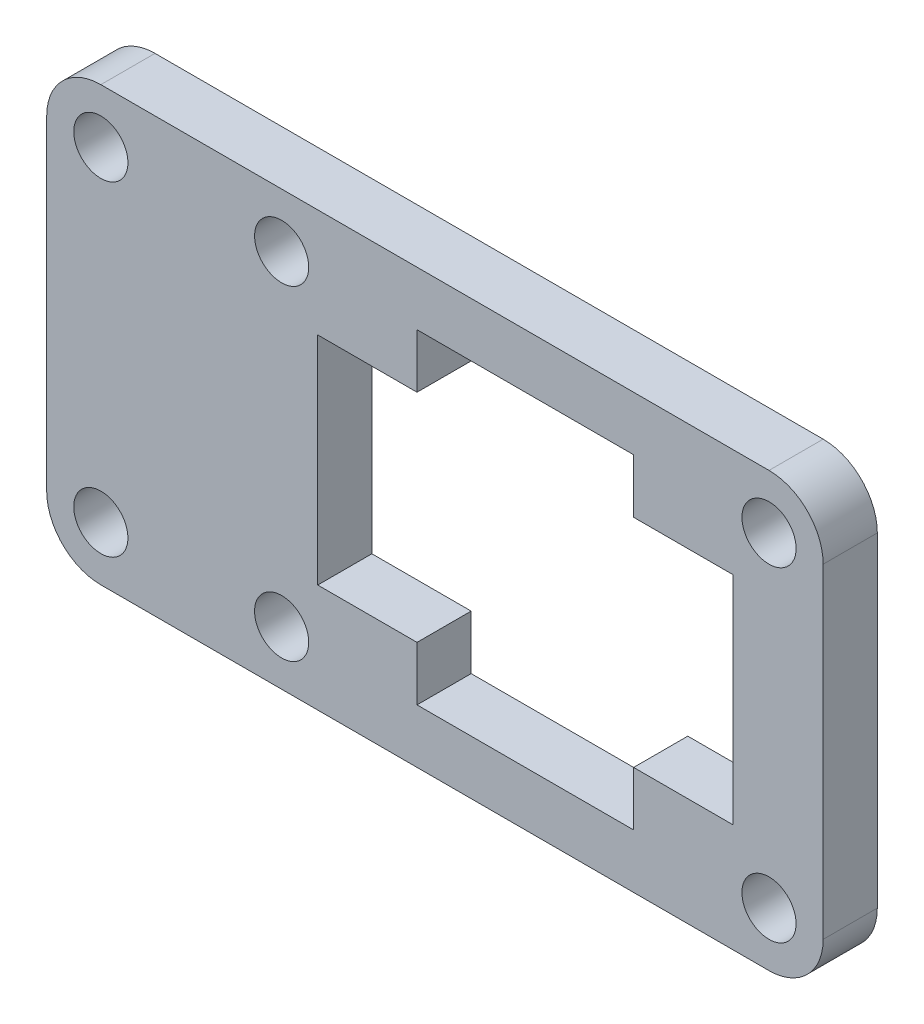
ISO-10303-21;
HEADER;
FILE_DESCRIPTION(('STEP AP214'),'2;1');
FILE_NAME('part.step','',(''),(''),'','','');
FILE_SCHEMA(('AUTOMOTIVE_DESIGN { 1 0 10303 214 1 1 1 1 }'));
ENDSEC;
DATA;
#1=APPLICATION_CONTEXT('core data for automotive mechanical design processes');
#2=APPLICATION_PROTOCOL_DEFINITION('international standard','automotive_design',2000,#1);
#3=PRODUCT_CONTEXT('',#1,'mechanical');
#4=PRODUCT('Part','Part','',(#3));
#5=PRODUCT_RELATED_PRODUCT_CATEGORY('part','',(#4));
#6=PRODUCT_DEFINITION_FORMATION('','',#4);
#7=PRODUCT_DEFINITION_CONTEXT('part definition',#1,'design');
#8=PRODUCT_DEFINITION('design','',#6,#7);
#9=PRODUCT_DEFINITION_SHAPE('','',#8);
#10=(LENGTH_UNIT() NAMED_UNIT(*) SI_UNIT(.MILLI.,.METRE.));
#11=(NAMED_UNIT(*) PLANE_ANGLE_UNIT() SI_UNIT($,.RADIAN.));
#12=(NAMED_UNIT(*) SI_UNIT($,.STERADIAN.) SOLID_ANGLE_UNIT());
#13=UNCERTAINTY_MEASURE_WITH_UNIT(LENGTH_MEASURE(1.E-05),#10,'distance_accuracy_value','');
#14=(GEOMETRIC_REPRESENTATION_CONTEXT(3) GLOBAL_UNCERTAINTY_ASSIGNED_CONTEXT((#13)) GLOBAL_UNIT_ASSIGNED_CONTEXT((#10,
#11,#12)) REPRESENTATION_CONTEXT('',''));
#15=CARTESIAN_POINT('',(0.,0.,0.));
#16=DIRECTION('',(0.,0.,1.));
#17=DIRECTION('',(1.,0.,0.));
#18=AXIS2_PLACEMENT_3D('',#15,#16,#17);
#19=CARTESIAN_POINT('',(63.748376395524,-38.3124718985925,3.));
#20=DIRECTION('',(0.,0.,-1.));
#21=DIRECTION('',(-1.,0.,0.));
#22=AXIS2_PLACEMENT_3D('',#19,#20,#21);
#23=PLANE('',#22);
#24=CARTESIAN_POINT('',(36.748376395524,-38.3124718985925,3.));
#25=DIRECTION('',(0.,0.,1.));
#26=DIRECTION('',(1.,0.,0.));
#27=AXIS2_PLACEMENT_3D('',#24,#25,#26);
#28=CIRCLE('',#27,1.5);
#29=CARTESIAN_POINT('',(38.248376395524,-38.3124718985925,3.));
#30=VERTEX_POINT('',#29);
#31=EDGE_CURVE('E471',#30,#30,#28,.T.);
#32=ORIENTED_EDGE('',*,*,#31,.F.);
#33=EDGE_LOOP('',(#32));
#34=FACE_BOUND('',#33,.T.);
#35=CARTESIAN_POINT('',(63.748376395524,-56.3124718985925,3.));
#36=DIRECTION('',(0.,0.,1.));
#37=DIRECTION('',(1.,0.,0.));
#38=AXIS2_PLACEMENT_3D('',#35,#36,#37);
#39=CIRCLE('',#38,1.5);
#40=CARTESIAN_POINT('',(65.248376395524,-56.3124718985925,3.));
#41=VERTEX_POINT('',#40);
#42=EDGE_CURVE('E483',#41,#41,#39,.T.);
#43=ORIENTED_EDGE('',*,*,#42,.F.);
#44=EDGE_LOOP('',(#43));
#45=FACE_BOUND('',#44,.T.);
#46=CARTESIAN_POINT('',(26.7321907696324,-38.3124718985925,3.));
#47=DIRECTION('',(0.,0.,1.));
#48=DIRECTION('',(1.,0.,0.));
#49=AXIS2_PLACEMENT_3D('',#46,#47,#48);
#50=CIRCLE('',#49,1.5);
#51=CARTESIAN_POINT('',(28.2321907696324,-38.3124718985925,3.));
#52=VERTEX_POINT('',#51);
#53=EDGE_CURVE('E222',#52,#52,#50,.T.);
#54=ORIENTED_EDGE('',*,*,#53,.F.);
#55=EDGE_LOOP('',(#54));
#56=FACE_BOUND('',#55,.T.);
#57=CARTESIAN_POINT('',(63.748376395524,-38.3124718985925,3.));
#58=DIRECTION('',(0.,0.,1.));
#59=DIRECTION('',(-1.,0.,0.));
#60=AXIS2_PLACEMENT_3D('',#57,#58,#59);
#61=CIRCLE('',#60,3.);
#62=CARTESIAN_POINT('',(66.748376395524,-38.3124718985925,3.));
#63=VERTEX_POINT('',#62);
#64=CARTESIAN_POINT('',(63.748376395524,-35.3124718985925,3.));
#65=VERTEX_POINT('',#64);
#66=EDGE_CURVE('E272',#63,#65,#61,.T.);
#67=ORIENTED_EDGE('',*,*,#66,.T.);
#68=DIRECTION('',(-1.,0.,0.));
#69=VECTOR('',#68,1.);
#70=CARTESIAN_POINT('',(26.7321907696324,-35.3124718985925,3.));
#71=LINE('',#70,#69);
#72=CARTESIAN_POINT('',(26.7321907696324,-35.3124718985925,3.));
#73=VERTEX_POINT('',#72);
#74=EDGE_CURVE('E275',#65,#73,#71,.T.);
#75=ORIENTED_EDGE('',*,*,#74,.T.);
#76=CARTESIAN_POINT('',(26.7321907696324,-38.3124718985925,3.));
#77=DIRECTION('',(0.,0.,1.));
#78=DIRECTION('',(1.,0.,0.));
#79=AXIS2_PLACEMENT_3D('',#76,#77,#78);
#80=CIRCLE('',#79,3.);
#81=CARTESIAN_POINT('',(23.7321907696324,-38.3124718985925,3.));
#82=VERTEX_POINT('',#81);
#83=EDGE_CURVE('E278',#73,#82,#80,.T.);
#84=ORIENTED_EDGE('',*,*,#83,.T.);
#85=DIRECTION('',(0.,-1.,0.));
#86=VECTOR('',#85,1.);
#87=CARTESIAN_POINT('',(23.7321907696324,-38.3124718985925,3.));
#88=LINE('',#87,#86);
#89=CARTESIAN_POINT('',(23.7321907696324,-56.3124718985925,3.));
#90=VERTEX_POINT('',#89);
#91=EDGE_CURVE('E280',#82,#90,#88,.T.);
#92=ORIENTED_EDGE('',*,*,#91,.T.);
#93=CARTESIAN_POINT('',(26.7321907696324,-56.3124718985925,3.));
#94=DIRECTION('',(0.,0.,1.));
#95=DIRECTION('',(1.,0.,0.));
#96=AXIS2_PLACEMENT_3D('',#93,#94,#95);
#97=CIRCLE('',#96,3.);
#98=CARTESIAN_POINT('',(26.7321907696324,-59.3124718985925,3.));
#99=VERTEX_POINT('',#98);
#100=EDGE_CURVE('E282',#90,#99,#97,.T.);
#101=ORIENTED_EDGE('',*,*,#100,.T.);
#102=DIRECTION('',(1.,0.,0.));
#103=VECTOR('',#102,1.);
#104=CARTESIAN_POINT('',(26.7321907696324,-59.3124718985925,3.));
#105=LINE('',#104,#103);
#106=CARTESIAN_POINT('',(63.748376395524,-59.3124718985925,3.));
#107=VERTEX_POINT('',#106);
#108=EDGE_CURVE('E284',#99,#107,#105,.T.);
#109=ORIENTED_EDGE('',*,*,#108,.T.);
#110=CARTESIAN_POINT('',(63.748376395524,-56.3124718985925,3.));
#111=DIRECTION('',(0.,0.,1.));
#112=DIRECTION('',(1.,0.,0.));
#113=AXIS2_PLACEMENT_3D('',#110,#111,#112);
#114=CIRCLE('',#113,3.);
#115=CARTESIAN_POINT('',(66.748376395524,-56.3124718985925,3.));
#116=VERTEX_POINT('',#115);
#117=EDGE_CURVE('E286',#107,#116,#114,.T.);
#118=ORIENTED_EDGE('',*,*,#117,.T.);
#119=DIRECTION('',(0.,1.,0.));
#120=VECTOR('',#119,1.);
#121=CARTESIAN_POINT('',(66.748376395524,-38.3124718985925,3.));
#122=LINE('',#121,#120);
#123=EDGE_CURVE('E288',#116,#63,#122,.T.);
#124=ORIENTED_EDGE('',*,*,#123,.T.);
#125=EDGE_LOOP('',(#67,#75,#84,#92,#101,#109,#118,#124));
#126=FACE_BOUND('',#125,.T.);
#127=DIRECTION('',(0.,-1.,0.));
#128=VECTOR('',#127,1.);
#129=CARTESIAN_POINT('',(38.748376395524,-53.3124718985925,3.));
#130=LINE('',#129,#128);
#131=CARTESIAN_POINT('',(38.748376395524,-41.3124718985925,3.));
#132=VERTEX_POINT('',#131);
#133=CARTESIAN_POINT('',(38.748376395524,-53.3124718985925,3.));
#134=VERTEX_POINT('',#133);
#135=EDGE_CURVE('E176',#132,#134,#130,.T.);
#136=ORIENTED_EDGE('',*,*,#135,.F.);
#137=DIRECTION('',(-1.,0.,0.));
#138=VECTOR('',#137,1.);
#139=CARTESIAN_POINT('',(38.748376395524,-41.3124718985925,3.));
#140=LINE('',#139,#138);
#141=CARTESIAN_POINT('',(44.248376395524,-41.3124718985925,3.));
#142=VERTEX_POINT('',#141);
#143=EDGE_CURVE('E219',#142,#132,#140,.T.);
#144=ORIENTED_EDGE('',*,*,#143,.F.);
#145=DIRECTION('',(0.,-1.,0.));
#146=VECTOR('',#145,1.);
#147=CARTESIAN_POINT('',(44.248376395524,-41.3124718985925,3.));
#148=LINE('',#147,#146);
#149=CARTESIAN_POINT('',(44.248376395524,-38.3124718985925,3.));
#150=VERTEX_POINT('',#149);
#151=EDGE_CURVE('E217',#150,#142,#148,.T.);
#152=ORIENTED_EDGE('',*,*,#151,.F.);
#153=DIRECTION('',(-1.,0.,0.));
#154=VECTOR('',#153,1.);
#155=CARTESIAN_POINT('',(56.248376395524,-38.3124718985925,3.));
#156=LINE('',#155,#154);
#157=CARTESIAN_POINT('',(56.248376395524,-38.3124718985925,3.));
#158=VERTEX_POINT('',#157);
#159=EDGE_CURVE('E215',#158,#150,#156,.T.);
#160=ORIENTED_EDGE('',*,*,#159,.F.);
#161=DIRECTION('',(0.,1.,0.));
#162=VECTOR('',#161,1.);
#163=CARTESIAN_POINT('',(56.248376395524,-41.3124718985925,3.));
#164=LINE('',#163,#162);
#165=CARTESIAN_POINT('',(56.248376395524,-41.3124718985925,3.));
#166=VERTEX_POINT('',#165);
#167=EDGE_CURVE('E213',#166,#158,#164,.T.);
#168=ORIENTED_EDGE('',*,*,#167,.F.);
#169=DIRECTION('',(-1.,0.,0.));
#170=VECTOR('',#169,1.);
#171=CARTESIAN_POINT('',(56.248376395524,-41.3124718985925,3.));
#172=LINE('',#171,#170);
#173=CARTESIAN_POINT('',(61.748376395524,-41.3124718985925,3.));
#174=VERTEX_POINT('',#173);
#175=EDGE_CURVE('E211',#174,#166,#172,.T.);
#176=ORIENTED_EDGE('',*,*,#175,.F.);
#177=DIRECTION('',(0.,1.,0.));
#178=VECTOR('',#177,1.);
#179=CARTESIAN_POINT('',(61.748376395524,-53.3124718985925,3.));
#180=LINE('',#179,#178);
#181=CARTESIAN_POINT('',(61.748376395524,-53.3124718985925,3.));
#182=VERTEX_POINT('',#181);
#183=EDGE_CURVE('E209',#182,#174,#180,.T.);
#184=ORIENTED_EDGE('',*,*,#183,.F.);
#185=DIRECTION('',(1.,0.,0.));
#186=VECTOR('',#185,1.);
#187=CARTESIAN_POINT('',(56.248376395524,-53.3124718985925,3.));
#188=LINE('',#187,#186);
#189=CARTESIAN_POINT('',(56.248376395524,-53.3124718985925,3.));
#190=VERTEX_POINT('',#189);
#191=EDGE_CURVE('E207',#190,#182,#188,.T.);
#192=ORIENTED_EDGE('',*,*,#191,.F.);
#193=DIRECTION('',(0.,1.,0.));
#194=VECTOR('',#193,1.);
#195=CARTESIAN_POINT('',(56.248376395524,-56.3124718985925,3.));
#196=LINE('',#195,#194);
#197=CARTESIAN_POINT('',(56.248376395524,-56.3124718985925,3.));
#198=VERTEX_POINT('',#197);
#199=EDGE_CURVE('E205',#198,#190,#196,.T.);
#200=ORIENTED_EDGE('',*,*,#199,.F.);
#201=DIRECTION('',(1.,0.,0.));
#202=VECTOR('',#201,1.);
#203=CARTESIAN_POINT('',(56.248376395524,-56.3124718985925,3.));
#204=LINE('',#203,#202);
#205=CARTESIAN_POINT('',(44.248376395524,-56.3124718985925,3.));
#206=VERTEX_POINT('',#205);
#207=EDGE_CURVE('E200',#206,#198,#204,.T.);
#208=ORIENTED_EDGE('',*,*,#207,.F.);
#209=DIRECTION('',(0.,-1.,0.));
#210=VECTOR('',#209,1.);
#211=CARTESIAN_POINT('',(44.248376395524,-56.3124718985925,3.));
#212=LINE('',#211,#210);
#213=CARTESIAN_POINT('',(44.248376395524,-53.3124718985925,3.));
#214=VERTEX_POINT('',#213);
#215=EDGE_CURVE('E198',#214,#206,#212,.T.);
#216=ORIENTED_EDGE('',*,*,#215,.F.);
#217=DIRECTION('',(1.,0.,0.));
#218=VECTOR('',#217,1.);
#219=CARTESIAN_POINT('',(38.748376395524,-53.3124718985925,3.));
#220=LINE('',#219,#218);
#221=EDGE_CURVE('E184',#134,#214,#220,.T.);
#222=ORIENTED_EDGE('',*,*,#221,.F.);
#223=EDGE_LOOP('',(#136,#144,#152,#160,#168,#176,#184,#192,#200,#208,#216,#222));
#224=FACE_BOUND('',#223,.T.);
#225=CARTESIAN_POINT('',(63.748376395524,-38.3124718985925,3.));
#226=DIRECTION('',(0.,0.,1.));
#227=DIRECTION('',(1.,0.,0.));
#228=AXIS2_PLACEMENT_3D('',#225,#226,#227);
#229=CIRCLE('',#228,1.5);
#230=CARTESIAN_POINT('',(65.248376395524,-38.3124718985925,3.));
#231=VERTEX_POINT('',#230);
#232=EDGE_CURVE('E489',#231,#231,#229,.T.);
#233=ORIENTED_EDGE('',*,*,#232,.F.);
#234=EDGE_LOOP('',(#233));
#235=FACE_BOUND('',#234,.T.);
#236=CARTESIAN_POINT('',(26.7321907696324,-56.3124718985925,3.));
#237=DIRECTION('',(0.,0.,1.));
#238=DIRECTION('',(1.,0.,0.));
#239=AXIS2_PLACEMENT_3D('',#236,#237,#238);
#240=CIRCLE('',#239,1.5);
#241=CARTESIAN_POINT('',(28.2321907696324,-56.3124718985925,3.));
#242=VERTEX_POINT('',#241);
#243=EDGE_CURVE('E477',#242,#242,#240,.T.);
#244=ORIENTED_EDGE('',*,*,#243,.F.);
#245=EDGE_LOOP('',(#244));
#246=FACE_BOUND('',#245,.T.);
#247=CARTESIAN_POINT('',(36.748376395524,-56.3124718985925,3.));
#248=DIRECTION('',(0.,0.,1.));
#249=DIRECTION('',(1.,0.,0.));
#250=AXIS2_PLACEMENT_3D('',#247,#248,#249);
#251=CIRCLE('',#250,1.5);
#252=CARTESIAN_POINT('',(38.248376395524,-56.3124718985925,3.));
#253=VERTEX_POINT('',#252);
#254=EDGE_CURVE('E462',#253,#253,#251,.T.);
#255=ORIENTED_EDGE('',*,*,#254,.F.);
#256=EDGE_LOOP('',(#255));
#257=FACE_BOUND('',#256,.T.);
#258=ADVANCED_FACE('F39',(#34,#45,#56,#126,#224,#235,#246,#257),#23,.F.);
#259=CARTESIAN_POINT('',(63.748376395524,-38.3124718985925,0.));
#260=DIRECTION('',(0.,0.,-1.));
#261=DIRECTION('',(-1.,0.,0.));
#262=AXIS2_PLACEMENT_3D('',#259,#260,#261);
#263=PLANE('',#262);
#264=CARTESIAN_POINT('',(36.748376395524,-38.3124718985925,0.));
#265=DIRECTION('',(0.,0.,1.));
#266=DIRECTION('',(1.,0.,0.));
#267=AXIS2_PLACEMENT_3D('',#264,#265,#266);
#268=CIRCLE('',#267,1.5);
#269=CARTESIAN_POINT('',(38.248376395524,-38.3124718985925,0.));
#270=VERTEX_POINT('',#269);
#271=EDGE_CURVE('E468',#270,#270,#268,.T.);
#272=ORIENTED_EDGE('',*,*,#271,.T.);
#273=EDGE_LOOP('',(#272));
#274=FACE_BOUND('',#273,.T.);
#275=CARTESIAN_POINT('',(63.748376395524,-56.3124718985925,0.));
#276=DIRECTION('',(0.,0.,1.));
#277=DIRECTION('',(1.,0.,0.));
#278=AXIS2_PLACEMENT_3D('',#275,#276,#277);
#279=CIRCLE('',#278,1.5);
#280=CARTESIAN_POINT('',(65.248376395524,-56.3124718985925,0.));
#281=VERTEX_POINT('',#280);
#282=EDGE_CURVE('E480',#281,#281,#279,.T.);
#283=ORIENTED_EDGE('',*,*,#282,.T.);
#284=EDGE_LOOP('',(#283));
#285=FACE_BOUND('',#284,.T.);
#286=CARTESIAN_POINT('',(26.7321907696324,-38.3124718985925,0.));
#287=DIRECTION('',(0.,0.,1.));
#288=DIRECTION('',(1.,0.,0.));
#289=AXIS2_PLACEMENT_3D('',#286,#287,#288);
#290=CIRCLE('',#289,1.5);
#291=CARTESIAN_POINT('',(28.2321907696324,-38.3124718985925,0.));
#292=VERTEX_POINT('',#291);
#293=EDGE_CURVE('E492',#292,#292,#290,.T.);
#294=ORIENTED_EDGE('',*,*,#293,.T.);
#295=EDGE_LOOP('',(#294));
#296=FACE_BOUND('',#295,.T.);
#297=CARTESIAN_POINT('',(63.748376395524,-38.3124718985925,0.));
#298=DIRECTION('',(0.,0.,1.));
#299=DIRECTION('',(-1.,0.,0.));
#300=AXIS2_PLACEMENT_3D('',#297,#298,#299);
#301=CIRCLE('',#300,3.);
#302=CARTESIAN_POINT('',(66.748376395524,-38.3124718985925,0.));
#303=VERTEX_POINT('',#302);
#304=CARTESIAN_POINT('',(63.748376395524,-35.3124718985925,0.));
#305=VERTEX_POINT('',#304);
#306=EDGE_CURVE('E192',#303,#305,#301,.T.);
#307=ORIENTED_EDGE('',*,*,#306,.F.);
#308=DIRECTION('',(0.,1.,0.));
#309=VECTOR('',#308,1.);
#310=CARTESIAN_POINT('',(66.748376395524,-38.3124718985925,0.));
#311=LINE('',#310,#309);
#312=CARTESIAN_POINT('',(66.748376395524,-56.3124718985925,0.));
#313=VERTEX_POINT('',#312);
#314=EDGE_CURVE('E276',#313,#303,#311,.T.);
#315=ORIENTED_EDGE('',*,*,#314,.F.);
#316=CARTESIAN_POINT('',(63.748376395524,-56.3124718985925,0.));
#317=DIRECTION('',(0.,0.,1.));
#318=DIRECTION('',(1.,0.,0.));
#319=AXIS2_PLACEMENT_3D('',#316,#317,#318);
#320=CIRCLE('',#319,3.);
#321=CARTESIAN_POINT('',(63.748376395524,-59.3124718985925,0.));
#322=VERTEX_POINT('',#321);
#323=EDGE_CURVE('E303',#322,#313,#320,.T.);
#324=ORIENTED_EDGE('',*,*,#323,.F.);
#325=DIRECTION('',(1.,0.,0.));
#326=VECTOR('',#325,1.);
#327=CARTESIAN_POINT('',(26.7321907696324,-59.3124718985925,0.));
#328=LINE('',#327,#326);
#329=CARTESIAN_POINT('',(26.7321907696324,-59.3124718985925,0.));
#330=VERTEX_POINT('',#329);
#331=EDGE_CURVE('E301',#330,#322,#328,.T.);
#332=ORIENTED_EDGE('',*,*,#331,.F.);
#333=CARTESIAN_POINT('',(26.7321907696324,-56.3124718985925,0.));
#334=DIRECTION('',(0.,0.,1.));
#335=DIRECTION('',(1.,0.,0.));
#336=AXIS2_PLACEMENT_3D('',#333,#334,#335);
#337=CIRCLE('',#336,3.);
#338=CARTESIAN_POINT('',(23.7321907696324,-56.3124718985925,0.));
#339=VERTEX_POINT('',#338);
#340=EDGE_CURVE('E299',#339,#330,#337,.T.);
#341=ORIENTED_EDGE('',*,*,#340,.F.);
#342=DIRECTION('',(0.,-1.,0.));
#343=VECTOR('',#342,1.);
#344=CARTESIAN_POINT('',(23.7321907696324,-38.3124718985925,0.));
#345=LINE('',#344,#343);
#346=CARTESIAN_POINT('',(23.7321907696324,-38.3124718985925,0.));
#347=VERTEX_POINT('',#346);
#348=EDGE_CURVE('E297',#347,#339,#345,.T.);
#349=ORIENTED_EDGE('',*,*,#348,.F.);
#350=CARTESIAN_POINT('',(26.7321907696324,-38.3124718985925,0.));
#351=DIRECTION('',(0.,0.,1.));
#352=DIRECTION('',(1.,0.,0.));
#353=AXIS2_PLACEMENT_3D('',#350,#351,#352);
#354=CIRCLE('',#353,3.);
#355=CARTESIAN_POINT('',(26.7321907696324,-35.3124718985925,0.));
#356=VERTEX_POINT('',#355);
#357=EDGE_CURVE('E295',#356,#347,#354,.T.);
#358=ORIENTED_EDGE('',*,*,#357,.F.);
#359=DIRECTION('',(-1.,0.,0.));
#360=VECTOR('',#359,1.);
#361=CARTESIAN_POINT('',(26.7321907696324,-35.3124718985925,0.));
#362=LINE('',#361,#360);
#363=EDGE_CURVE('E293',#305,#356,#362,.T.);
#364=ORIENTED_EDGE('',*,*,#363,.F.);
#365=EDGE_LOOP('',(#307,#315,#324,#332,#341,#349,#358,#364));
#366=FACE_BOUND('',#365,.T.);
#367=DIRECTION('',(-1.,0.,0.));
#368=VECTOR('',#367,1.);
#369=CARTESIAN_POINT('',(38.748376395524,-41.3124718985925,0.));
#370=LINE('',#369,#368);
#371=CARTESIAN_POINT('',(44.248376395524,-41.3124718985925,0.));
#372=VERTEX_POINT('',#371);
#373=CARTESIAN_POINT('',(38.748376395524,-41.3124718985925,0.));
#374=VERTEX_POINT('',#373);
#375=EDGE_CURVE('E185',#372,#374,#370,.T.);
#376=ORIENTED_EDGE('',*,*,#375,.T.);
#377=DIRECTION('',(0.,-1.,0.));
#378=VECTOR('',#377,1.);
#379=CARTESIAN_POINT('',(38.748376395524,-53.3124718985925,0.));
#380=LINE('',#379,#378);
#381=CARTESIAN_POINT('',(38.748376395524,-53.3124718985925,0.));
#382=VERTEX_POINT('',#381);
#383=EDGE_CURVE('E62',#374,#382,#380,.T.);
#384=ORIENTED_EDGE('',*,*,#383,.T.);
#385=DIRECTION('',(1.,0.,0.));
#386=VECTOR('',#385,1.);
#387=CARTESIAN_POINT('',(38.748376395524,-53.3124718985925,0.));
#388=LINE('',#387,#386);
#389=CARTESIAN_POINT('',(44.248376395524,-53.3124718985925,0.));
#390=VERTEX_POINT('',#389);
#391=EDGE_CURVE('E191',#382,#390,#388,.T.);
#392=ORIENTED_EDGE('',*,*,#391,.T.);
#393=DIRECTION('',(0.,-1.,0.));
#394=VECTOR('',#393,1.);
#395=CARTESIAN_POINT('',(44.248376395524,-56.3124718985925,0.));
#396=LINE('',#395,#394);
#397=CARTESIAN_POINT('',(44.248376395524,-56.3124718985925,0.));
#398=VERTEX_POINT('',#397);
#399=EDGE_CURVE('E224',#390,#398,#396,.T.);
#400=ORIENTED_EDGE('',*,*,#399,.T.);
#401=DIRECTION('',(1.,0.,0.));
#402=VECTOR('',#401,1.);
#403=CARTESIAN_POINT('',(56.248376395524,-56.3124718985925,0.));
#404=LINE('',#403,#402);
#405=CARTESIAN_POINT('',(56.248376395524,-56.3124718985925,0.));
#406=VERTEX_POINT('',#405);
#407=EDGE_CURVE('E227',#398,#406,#404,.T.);
#408=ORIENTED_EDGE('',*,*,#407,.T.);
#409=DIRECTION('',(0.,1.,0.));
#410=VECTOR('',#409,1.);
#411=CARTESIAN_POINT('',(56.248376395524,-56.3124718985925,0.));
#412=LINE('',#411,#410);
#413=CARTESIAN_POINT('',(56.248376395524,-53.3124718985925,0.));
#414=VERTEX_POINT('',#413);
#415=EDGE_CURVE('E230',#406,#414,#412,.T.);
#416=ORIENTED_EDGE('',*,*,#415,.T.);
#417=DIRECTION('',(1.,0.,0.));
#418=VECTOR('',#417,1.);
#419=CARTESIAN_POINT('',(56.248376395524,-53.3124718985925,0.));
#420=LINE('',#419,#418);
#421=CARTESIAN_POINT('',(61.748376395524,-53.3124718985925,0.));
#422=VERTEX_POINT('',#421);
#423=EDGE_CURVE('E233',#414,#422,#420,.T.);
#424=ORIENTED_EDGE('',*,*,#423,.T.);
#425=DIRECTION('',(0.,1.,0.));
#426=VECTOR('',#425,1.);
#427=CARTESIAN_POINT('',(61.748376395524,-53.3124718985925,0.));
#428=LINE('',#427,#426);
#429=CARTESIAN_POINT('',(61.748376395524,-41.3124718985925,0.));
#430=VERTEX_POINT('',#429);
#431=EDGE_CURVE('E236',#422,#430,#428,.T.);
#432=ORIENTED_EDGE('',*,*,#431,.T.);
#433=DIRECTION('',(-1.,0.,0.));
#434=VECTOR('',#433,1.);
#435=CARTESIAN_POINT('',(56.248376395524,-41.3124718985925,0.));
#436=LINE('',#435,#434);
#437=CARTESIAN_POINT('',(56.248376395524,-41.3124718985925,0.));
#438=VERTEX_POINT('',#437);
#439=EDGE_CURVE('E239',#430,#438,#436,.T.);
#440=ORIENTED_EDGE('',*,*,#439,.T.);
#441=DIRECTION('',(0.,1.,0.));
#442=VECTOR('',#441,1.);
#443=CARTESIAN_POINT('',(56.248376395524,-41.3124718985925,0.));
#444=LINE('',#443,#442);
#445=CARTESIAN_POINT('',(56.248376395524,-38.3124718985925,0.));
#446=VERTEX_POINT('',#445);
#447=EDGE_CURVE('E242',#438,#446,#444,.T.);
#448=ORIENTED_EDGE('',*,*,#447,.T.);
#449=DIRECTION('',(-1.,0.,0.));
#450=VECTOR('',#449,1.);
#451=CARTESIAN_POINT('',(56.248376395524,-38.3124718985925,0.));
#452=LINE('',#451,#450);
#453=CARTESIAN_POINT('',(44.248376395524,-38.3124718985925,0.));
#454=VERTEX_POINT('',#453);
#455=EDGE_CURVE('E245',#446,#454,#452,.T.);
#456=ORIENTED_EDGE('',*,*,#455,.T.);
#457=DIRECTION('',(0.,-1.,0.));
#458=VECTOR('',#457,1.);
#459=CARTESIAN_POINT('',(44.248376395524,-41.3124718985925,0.));
#460=LINE('',#459,#458);
#461=EDGE_CURVE('E248',#454,#372,#460,.T.);
#462=ORIENTED_EDGE('',*,*,#461,.T.);
#463=EDGE_LOOP('',(#376,#384,#392,#400,#408,#416,#424,#432,#440,#448,#456,#462));
#464=FACE_BOUND('',#463,.T.);
#465=CARTESIAN_POINT('',(63.748376395524,-38.3124718985925,0.));
#466=DIRECTION('',(0.,0.,1.));
#467=DIRECTION('',(1.,0.,0.));
#468=AXIS2_PLACEMENT_3D('',#465,#466,#467);
#469=CIRCLE('',#468,1.5);
#470=CARTESIAN_POINT('',(65.248376395524,-38.3124718985925,0.));
#471=VERTEX_POINT('',#470);
#472=EDGE_CURVE('E486',#471,#471,#469,.T.);
#473=ORIENTED_EDGE('',*,*,#472,.T.);
#474=EDGE_LOOP('',(#473));
#475=FACE_BOUND('',#474,.T.);
#476=CARTESIAN_POINT('',(26.7321907696324,-56.3124718985925,0.));
#477=DIRECTION('',(0.,0.,1.));
#478=DIRECTION('',(1.,0.,0.));
#479=AXIS2_PLACEMENT_3D('',#476,#477,#478);
#480=CIRCLE('',#479,1.5);
#481=CARTESIAN_POINT('',(28.2321907696324,-56.3124718985925,0.));
#482=VERTEX_POINT('',#481);
#483=EDGE_CURVE('E474',#482,#482,#480,.T.);
#484=ORIENTED_EDGE('',*,*,#483,.T.);
#485=EDGE_LOOP('',(#484));
#486=FACE_BOUND('',#485,.T.);
#487=CARTESIAN_POINT('',(36.748376395524,-56.3124718985925,0.));
#488=DIRECTION('',(0.,0.,1.));
#489=DIRECTION('',(1.,0.,0.));
#490=AXIS2_PLACEMENT_3D('',#487,#488,#489);
#491=CIRCLE('',#490,1.5);
#492=CARTESIAN_POINT('',(38.248376395524,-56.3124718985925,0.));
#493=VERTEX_POINT('',#492);
#494=EDGE_CURVE('E465',#493,#493,#491,.T.);
#495=ORIENTED_EDGE('',*,*,#494,.T.);
#496=EDGE_LOOP('',(#495));
#497=FACE_BOUND('',#496,.T.);
#498=ADVANCED_FACE('F333',(#274,#285,#296,#366,#464,#475,#486,#497),#263,.T.);
#499=CARTESIAN_POINT('',(63.748376395524,-38.3124718985925,3.));
#500=DIRECTION('',(0.,0.,-1.));
#501=DIRECTION('',(-1.,0.,0.));
#502=AXIS2_PLACEMENT_3D('',#499,#500,#501);
#503=CYLINDRICAL_SURFACE('',#502,3.);
#504=ORIENTED_EDGE('',*,*,#306,.T.);
#505=DIRECTION('',(0.,0.,-1.));
#506=VECTOR('',#505,1.);
#507=CARTESIAN_POINT('',(63.748376395524,-35.3124718985925,3.));
#508=LINE('',#507,#506);
#509=EDGE_CURVE('E11',#65,#305,#508,.T.);
#510=ORIENTED_EDGE('',*,*,#509,.F.);
#511=ORIENTED_EDGE('',*,*,#66,.F.);
#512=DIRECTION('',(0.,0.,-1.));
#513=VECTOR('',#512,1.);
#514=CARTESIAN_POINT('',(66.748376395524,-38.3124718985925,3.));
#515=LINE('',#514,#513);
#516=EDGE_CURVE('E290',#63,#303,#515,.T.);
#517=ORIENTED_EDGE('',*,*,#516,.T.);
#518=EDGE_LOOP('',(#504,#510,#511,#517));
#519=FACE_BOUND('',#518,.T.);
#520=ADVANCED_FACE('F41',(#519),#503,.T.);
#521=CARTESIAN_POINT('',(26.7321907696324,-35.3124718985925,3.));
#522=DIRECTION('',(0.,-1.,0.));
#523=DIRECTION('',(0.,0.,-1.));
#524=AXIS2_PLACEMENT_3D('',#521,#522,#523);
#525=PLANE('',#524);
#526=ORIENTED_EDGE('',*,*,#363,.T.);
#527=DIRECTION('',(0.,0.,-1.));
#528=VECTOR('',#527,1.);
#529=CARTESIAN_POINT('',(26.7321907696324,-35.3124718985925,3.));
#530=LINE('',#529,#528);
#531=EDGE_CURVE('E47',#73,#356,#530,.T.);
#532=ORIENTED_EDGE('',*,*,#531,.F.);
#533=ORIENTED_EDGE('',*,*,#74,.F.);
#534=ORIENTED_EDGE('',*,*,#509,.T.);
#535=EDGE_LOOP('',(#526,#532,#533,#534));
#536=FACE_BOUND('',#535,.T.);
#537=ADVANCED_FACE('F350',(#536),#525,.F.);
#538=CARTESIAN_POINT('',(26.7321907696324,-38.3124718985925,3.));
#539=DIRECTION('',(0.,0.,-1.));
#540=DIRECTION('',(-1.,0.,0.));
#541=AXIS2_PLACEMENT_3D('',#538,#539,#540);
#542=CYLINDRICAL_SURFACE('',#541,3.);
#543=ORIENTED_EDGE('',*,*,#357,.T.);
#544=DIRECTION('',(0.,0.,-1.));
#545=VECTOR('',#544,1.);
#546=CARTESIAN_POINT('',(23.7321907696324,-38.3124718985925,3.));
#547=LINE('',#546,#545);
#548=EDGE_CURVE('E320',#82,#347,#547,.T.);
#549=ORIENTED_EDGE('',*,*,#548,.F.);
#550=ORIENTED_EDGE('',*,*,#83,.F.);
#551=ORIENTED_EDGE('',*,*,#531,.T.);
#552=EDGE_LOOP('',(#543,#549,#550,#551));
#553=FACE_BOUND('',#552,.T.);
#554=ADVANCED_FACE('F327',(#553),#542,.T.);
#555=CARTESIAN_POINT('',(23.7321907696324,-38.3124718985925,3.));
#556=DIRECTION('',(1.,0.,0.));
#557=DIRECTION('',(0.,1.,0.));
#558=AXIS2_PLACEMENT_3D('',#555,#556,#557);
#559=PLANE('',#558);
#560=ORIENTED_EDGE('',*,*,#348,.T.);
#561=DIRECTION('',(0.,0.,-1.));
#562=VECTOR('',#561,1.);
#563=CARTESIAN_POINT('',(23.7321907696324,-56.3124718985925,3.));
#564=LINE('',#563,#562);
#565=EDGE_CURVE('E317',#90,#339,#564,.T.);
#566=ORIENTED_EDGE('',*,*,#565,.F.);
#567=ORIENTED_EDGE('',*,*,#91,.F.);
#568=ORIENTED_EDGE('',*,*,#548,.T.);
#569=EDGE_LOOP('',(#560,#566,#567,#568));
#570=FACE_BOUND('',#569,.T.);
#571=ADVANCED_FACE('F339',(#570),#559,.F.);
#572=CARTESIAN_POINT('',(26.7321907696324,-56.3124718985925,3.));
#573=DIRECTION('',(0.,0.,-1.));
#574=DIRECTION('',(-1.,0.,0.));
#575=AXIS2_PLACEMENT_3D('',#572,#573,#574);
#576=CYLINDRICAL_SURFACE('',#575,3.);
#577=ORIENTED_EDGE('',*,*,#340,.T.);
#578=DIRECTION('',(0.,0.,-1.));
#579=VECTOR('',#578,1.);
#580=CARTESIAN_POINT('',(26.7321907696324,-59.3124718985925,3.));
#581=LINE('',#580,#579);
#582=EDGE_CURVE('E314',#99,#330,#581,.T.);
#583=ORIENTED_EDGE('',*,*,#582,.F.);
#584=ORIENTED_EDGE('',*,*,#100,.F.);
#585=ORIENTED_EDGE('',*,*,#565,.T.);
#586=EDGE_LOOP('',(#577,#583,#584,#585));
#587=FACE_BOUND('',#586,.T.);
#588=ADVANCED_FACE('F343',(#587),#576,.T.);
#589=CARTESIAN_POINT('',(26.7321907696324,-59.3124718985925,3.));
#590=DIRECTION('',(0.,1.,0.));
#591=DIRECTION('',(0.,0.,1.));
#592=AXIS2_PLACEMENT_3D('',#589,#590,#591);
#593=PLANE('',#592);
#594=ORIENTED_EDGE('',*,*,#331,.T.);
#595=DIRECTION('',(0.,0.,-1.));
#596=VECTOR('',#595,1.);
#597=CARTESIAN_POINT('',(63.748376395524,-59.3124718985925,3.));
#598=LINE('',#597,#596);
#599=EDGE_CURVE('E311',#107,#322,#598,.T.);
#600=ORIENTED_EDGE('',*,*,#599,.F.);
#601=ORIENTED_EDGE('',*,*,#108,.F.);
#602=ORIENTED_EDGE('',*,*,#582,.T.);
#603=EDGE_LOOP('',(#594,#600,#601,#602));
#604=FACE_BOUND('',#603,.T.);
#605=ADVANCED_FACE('F363',(#604),#593,.F.);
#606=CARTESIAN_POINT('',(63.748376395524,-56.3124718985925,3.));
#607=DIRECTION('',(0.,0.,-1.));
#608=DIRECTION('',(-1.,0.,0.));
#609=AXIS2_PLACEMENT_3D('',#606,#607,#608);
#610=CYLINDRICAL_SURFACE('',#609,3.);
#611=ORIENTED_EDGE('',*,*,#323,.T.);
#612=DIRECTION('',(0.,0.,-1.));
#613=VECTOR('',#612,1.);
#614=CARTESIAN_POINT('',(66.748376395524,-56.3124718985925,3.));
#615=LINE('',#614,#613);
#616=EDGE_CURVE('E308',#116,#313,#615,.T.);
#617=ORIENTED_EDGE('',*,*,#616,.F.);
#618=ORIENTED_EDGE('',*,*,#117,.F.);
#619=ORIENTED_EDGE('',*,*,#599,.T.);
#620=EDGE_LOOP('',(#611,#617,#618,#619));
#621=FACE_BOUND('',#620,.T.);
#622=ADVANCED_FACE('F361',(#621),#610,.T.);
#623=CARTESIAN_POINT('',(66.748376395524,-38.3124718985925,3.));
#624=DIRECTION('',(-1.,0.,0.));
#625=DIRECTION('',(0.,-1.,0.));
#626=AXIS2_PLACEMENT_3D('',#623,#624,#625);
#627=PLANE('',#626);
#628=ORIENTED_EDGE('',*,*,#314,.T.);
#629=ORIENTED_EDGE('',*,*,#516,.F.);
#630=ORIENTED_EDGE('',*,*,#123,.F.);
#631=ORIENTED_EDGE('',*,*,#616,.T.);
#632=EDGE_LOOP('',(#628,#629,#630,#631));
#633=FACE_BOUND('',#632,.T.);
#634=ADVANCED_FACE('F356',(#633),#627,.F.);
#635=CARTESIAN_POINT('',(38.748376395524,-53.3124718985925,3.));
#636=DIRECTION('',(1.,0.,0.));
#637=DIRECTION('',(0.,1.,0.));
#638=AXIS2_PLACEMENT_3D('',#635,#636,#637);
#639=PLANE('',#638);
#640=ORIENTED_EDGE('',*,*,#383,.F.);
#641=DIRECTION('',(0.,0.,-1.));
#642=VECTOR('',#641,1.);
#643=CARTESIAN_POINT('',(38.748376395524,-41.3124718985925,3.));
#644=LINE('',#643,#642);
#645=EDGE_CURVE('E180',#132,#374,#644,.T.);
#646=ORIENTED_EDGE('',*,*,#645,.F.);
#647=ORIENTED_EDGE('',*,*,#135,.T.);
#648=DIRECTION('',(0.,0.,-1.));
#649=VECTOR('',#648,1.);
#650=CARTESIAN_POINT('',(38.748376395524,-53.3124718985925,3.));
#651=LINE('',#650,#649);
#652=EDGE_CURVE('E179',#134,#382,#651,.T.);
#653=ORIENTED_EDGE('',*,*,#652,.T.);
#654=EDGE_LOOP('',(#640,#646,#647,#653));
#655=FACE_BOUND('',#654,.T.);
#656=ADVANCED_FACE('F178',(#655),#639,.T.);
#657=CARTESIAN_POINT('',(38.748376395524,-53.3124718985925,3.));
#658=DIRECTION('',(0.,1.,0.));
#659=DIRECTION('',(0.,0.,1.));
#660=AXIS2_PLACEMENT_3D('',#657,#658,#659);
#661=PLANE('',#660);
#662=ORIENTED_EDGE('',*,*,#391,.F.);
#663=ORIENTED_EDGE('',*,*,#652,.F.);
#664=ORIENTED_EDGE('',*,*,#221,.T.);
#665=DIRECTION('',(0.,0.,-1.));
#666=VECTOR('',#665,1.);
#667=CARTESIAN_POINT('',(44.248376395524,-53.3124718985925,3.));
#668=LINE('',#667,#666);
#669=EDGE_CURVE('E193',#214,#390,#668,.T.);
#670=ORIENTED_EDGE('',*,*,#669,.T.);
#671=EDGE_LOOP('',(#662,#663,#664,#670));
#672=FACE_BOUND('',#671,.T.);
#673=ADVANCED_FACE('F188',(#672),#661,.T.);
#674=CARTESIAN_POINT('',(44.248376395524,-56.3124718985925,3.));
#675=DIRECTION('',(1.,0.,0.));
#676=DIRECTION('',(0.,0.,-1.));
#677=AXIS2_PLACEMENT_3D('',#674,#675,#676);
#678=PLANE('',#677);
#679=ORIENTED_EDGE('',*,*,#399,.F.);
#680=ORIENTED_EDGE('',*,*,#669,.F.);
#681=ORIENTED_EDGE('',*,*,#215,.T.);
#682=DIRECTION('',(0.,0.,-1.));
#683=VECTOR('',#682,1.);
#684=CARTESIAN_POINT('',(44.248376395524,-56.3124718985925,3.));
#685=LINE('',#684,#683);
#686=EDGE_CURVE('E269',#206,#398,#685,.T.);
#687=ORIENTED_EDGE('',*,*,#686,.T.);
#688=EDGE_LOOP('',(#679,#680,#681,#687));
#689=FACE_BOUND('',#688,.T.);
#690=ADVANCED_FACE('F392',(#689),#678,.T.);
#691=CARTESIAN_POINT('',(56.248376395524,-56.3124718985925,3.));
#692=DIRECTION('',(0.,1.,0.));
#693=DIRECTION('',(0.,0.,1.));
#694=AXIS2_PLACEMENT_3D('',#691,#692,#693);
#695=PLANE('',#694);
#696=ORIENTED_EDGE('',*,*,#407,.F.);
#697=ORIENTED_EDGE('',*,*,#686,.F.);
#698=ORIENTED_EDGE('',*,*,#207,.T.);
#699=DIRECTION('',(0.,0.,-1.));
#700=VECTOR('',#699,1.);
#701=CARTESIAN_POINT('',(56.248376395524,-56.3124718985925,3.));
#702=LINE('',#701,#700);
#703=EDGE_CURVE('E267',#198,#406,#702,.T.);
#704=ORIENTED_EDGE('',*,*,#703,.T.);
#705=EDGE_LOOP('',(#696,#697,#698,#704));
#706=FACE_BOUND('',#705,.T.);
#707=ADVANCED_FACE('F396',(#706),#695,.T.);
#708=CARTESIAN_POINT('',(56.248376395524,-56.3124718985925,3.));
#709=DIRECTION('',(-1.,0.,0.));
#710=DIRECTION('',(0.,0.,1.));
#711=AXIS2_PLACEMENT_3D('',#708,#709,#710);
#712=PLANE('',#711);
#713=ORIENTED_EDGE('',*,*,#415,.F.);
#714=ORIENTED_EDGE('',*,*,#703,.F.);
#715=ORIENTED_EDGE('',*,*,#199,.T.);
#716=DIRECTION('',(0.,0.,-1.));
#717=VECTOR('',#716,1.);
#718=CARTESIAN_POINT('',(56.248376395524,-53.3124718985925,3.));
#719=LINE('',#718,#717);
#720=EDGE_CURVE('E265',#190,#414,#719,.T.);
#721=ORIENTED_EDGE('',*,*,#720,.T.);
#722=EDGE_LOOP('',(#713,#714,#715,#721));
#723=FACE_BOUND('',#722,.T.);
#724=ADVANCED_FACE('F402',(#723),#712,.T.);
#725=CARTESIAN_POINT('',(56.248376395524,-53.3124718985925,3.));
#726=DIRECTION('',(0.,1.,0.));
#727=DIRECTION('',(0.,0.,1.));
#728=AXIS2_PLACEMENT_3D('',#725,#726,#727);
#729=PLANE('',#728);
#730=ORIENTED_EDGE('',*,*,#423,.F.);
#731=ORIENTED_EDGE('',*,*,#720,.F.);
#732=ORIENTED_EDGE('',*,*,#191,.T.);
#733=DIRECTION('',(0.,0.,-1.));
#734=VECTOR('',#733,1.);
#735=CARTESIAN_POINT('',(61.748376395524,-53.3124718985925,3.));
#736=LINE('',#735,#734);
#737=EDGE_CURVE('E263',#182,#422,#736,.T.);
#738=ORIENTED_EDGE('',*,*,#737,.T.);
#739=EDGE_LOOP('',(#730,#731,#732,#738));
#740=FACE_BOUND('',#739,.T.);
#741=ADVANCED_FACE('F406',(#740),#729,.T.);
#742=CARTESIAN_POINT('',(61.748376395524,-53.3124718985925,3.));
#743=DIRECTION('',(-1.,0.,0.));
#744=DIRECTION('',(0.,-1.,0.));
#745=AXIS2_PLACEMENT_3D('',#742,#743,#744);
#746=PLANE('',#745);
#747=ORIENTED_EDGE('',*,*,#431,.F.);
#748=ORIENTED_EDGE('',*,*,#737,.F.);
#749=ORIENTED_EDGE('',*,*,#183,.T.);
#750=DIRECTION('',(0.,0.,-1.));
#751=VECTOR('',#750,1.);
#752=CARTESIAN_POINT('',(61.748376395524,-41.3124718985925,3.));
#753=LINE('',#752,#751);
#754=EDGE_CURVE('E261',#174,#430,#753,.T.);
#755=ORIENTED_EDGE('',*,*,#754,.T.);
#756=EDGE_LOOP('',(#747,#748,#749,#755));
#757=FACE_BOUND('',#756,.T.);
#758=ADVANCED_FACE('F410',(#757),#746,.T.);
#759=CARTESIAN_POINT('',(56.248376395524,-41.3124718985925,3.));
#760=DIRECTION('',(0.,-1.,0.));
#761=DIRECTION('',(0.,0.,-1.));
#762=AXIS2_PLACEMENT_3D('',#759,#760,#761);
#763=PLANE('',#762);
#764=ORIENTED_EDGE('',*,*,#439,.F.);
#765=ORIENTED_EDGE('',*,*,#754,.F.);
#766=ORIENTED_EDGE('',*,*,#175,.T.);
#767=DIRECTION('',(0.,0.,-1.));
#768=VECTOR('',#767,1.);
#769=CARTESIAN_POINT('',(56.248376395524,-41.3124718985925,3.));
#770=LINE('',#769,#768);
#771=EDGE_CURVE('E259',#166,#438,#770,.T.);
#772=ORIENTED_EDGE('',*,*,#771,.T.);
#773=EDGE_LOOP('',(#764,#765,#766,#772));
#774=FACE_BOUND('',#773,.T.);
#775=ADVANCED_FACE('F414',(#774),#763,.T.);
#776=CARTESIAN_POINT('',(56.248376395524,-41.3124718985925,3.));
#777=DIRECTION('',(-1.,0.,0.));
#778=DIRECTION('',(0.,0.,1.));
#779=AXIS2_PLACEMENT_3D('',#776,#777,#778);
#780=PLANE('',#779);
#781=ORIENTED_EDGE('',*,*,#447,.F.);
#782=ORIENTED_EDGE('',*,*,#771,.F.);
#783=ORIENTED_EDGE('',*,*,#167,.T.);
#784=DIRECTION('',(0.,0.,-1.));
#785=VECTOR('',#784,1.);
#786=CARTESIAN_POINT('',(56.248376395524,-38.3124718985925,3.));
#787=LINE('',#786,#785);
#788=EDGE_CURVE('E257',#158,#446,#787,.T.);
#789=ORIENTED_EDGE('',*,*,#788,.T.);
#790=EDGE_LOOP('',(#781,#782,#783,#789));
#791=FACE_BOUND('',#790,.T.);
#792=ADVANCED_FACE('F418',(#791),#780,.T.);
#793=CARTESIAN_POINT('',(56.248376395524,-38.3124718985925,3.));
#794=DIRECTION('',(0.,-1.,0.));
#795=DIRECTION('',(0.,0.,-1.));
#796=AXIS2_PLACEMENT_3D('',#793,#794,#795);
#797=PLANE('',#796);
#798=ORIENTED_EDGE('',*,*,#455,.F.);
#799=ORIENTED_EDGE('',*,*,#788,.F.);
#800=ORIENTED_EDGE('',*,*,#159,.T.);
#801=DIRECTION('',(0.,0.,-1.));
#802=VECTOR('',#801,1.);
#803=CARTESIAN_POINT('',(44.248376395524,-38.3124718985925,3.));
#804=LINE('',#803,#802);
#805=EDGE_CURVE('E255',#150,#454,#804,.T.);
#806=ORIENTED_EDGE('',*,*,#805,.T.);
#807=EDGE_LOOP('',(#798,#799,#800,#806));
#808=FACE_BOUND('',#807,.T.);
#809=ADVANCED_FACE('F422',(#808),#797,.T.);
#810=CARTESIAN_POINT('',(44.248376395524,-41.3124718985925,3.));
#811=DIRECTION('',(1.,0.,0.));
#812=DIRECTION('',(0.,0.,-1.));
#813=AXIS2_PLACEMENT_3D('',#810,#811,#812);
#814=PLANE('',#813);
#815=ORIENTED_EDGE('',*,*,#461,.F.);
#816=ORIENTED_EDGE('',*,*,#805,.F.);
#817=ORIENTED_EDGE('',*,*,#151,.T.);
#818=DIRECTION('',(0.,0.,-1.));
#819=VECTOR('',#818,1.);
#820=CARTESIAN_POINT('',(44.248376395524,-41.3124718985925,3.));
#821=LINE('',#820,#819);
#822=EDGE_CURVE('E54',#142,#372,#821,.T.);
#823=ORIENTED_EDGE('',*,*,#822,.T.);
#824=EDGE_LOOP('',(#815,#816,#817,#823));
#825=FACE_BOUND('',#824,.T.);
#826=ADVANCED_FACE('F426',(#825),#814,.T.);
#827=CARTESIAN_POINT('',(38.748376395524,-41.3124718985925,3.));
#828=DIRECTION('',(0.,-1.,0.));
#829=DIRECTION('',(0.,0.,-1.));
#830=AXIS2_PLACEMENT_3D('',#827,#828,#829);
#831=PLANE('',#830);
#832=ORIENTED_EDGE('',*,*,#375,.F.);
#833=ORIENTED_EDGE('',*,*,#822,.F.);
#834=ORIENTED_EDGE('',*,*,#143,.T.);
#835=ORIENTED_EDGE('',*,*,#645,.T.);
#836=EDGE_LOOP('',(#832,#833,#834,#835));
#837=FACE_BOUND('',#836,.T.);
#838=ADVANCED_FACE('F430',(#837),#831,.T.);
#839=CARTESIAN_POINT('',(26.7321907696324,-38.3124718985925,3.));
#840=DIRECTION('',(0.,0.,-1.));
#841=DIRECTION('',(-1.,0.,0.));
#842=AXIS2_PLACEMENT_3D('',#839,#840,#841);
#843=CYLINDRICAL_SURFACE('',#842,1.5);
#844=ORIENTED_EDGE('',*,*,#53,.T.);
#845=EDGE_LOOP('',(#844));
#846=FACE_BOUND('',#845,.T.);
#847=ORIENTED_EDGE('',*,*,#293,.F.);
#848=EDGE_LOOP('',(#847));
#849=FACE_BOUND('',#848,.T.);
#850=ADVANCED_FACE('F434',(#846,#849),#843,.F.);
#851=CARTESIAN_POINT('',(63.748376395524,-38.3124718985925,3.));
#852=DIRECTION('',(0.,0.,-1.));
#853=DIRECTION('',(-1.,0.,0.));
#854=AXIS2_PLACEMENT_3D('',#851,#852,#853);
#855=CYLINDRICAL_SURFACE('',#854,1.5);
#856=ORIENTED_EDGE('',*,*,#232,.T.);
#857=EDGE_LOOP('',(#856));
#858=FACE_BOUND('',#857,.T.);
#859=ORIENTED_EDGE('',*,*,#472,.F.);
#860=EDGE_LOOP('',(#859));
#861=FACE_BOUND('',#860,.T.);
#862=ADVANCED_FACE('F437',(#858,#861),#855,.F.);
#863=CARTESIAN_POINT('',(63.748376395524,-56.3124718985925,3.));
#864=DIRECTION('',(0.,0.,-1.));
#865=DIRECTION('',(-1.,0.,0.));
#866=AXIS2_PLACEMENT_3D('',#863,#864,#865);
#867=CYLINDRICAL_SURFACE('',#866,1.5);
#868=ORIENTED_EDGE('',*,*,#42,.T.);
#869=EDGE_LOOP('',(#868));
#870=FACE_BOUND('',#869,.T.);
#871=ORIENTED_EDGE('',*,*,#282,.F.);
#872=EDGE_LOOP('',(#871));
#873=FACE_BOUND('',#872,.T.);
#874=ADVANCED_FACE('F441',(#870,#873),#867,.F.);
#875=CARTESIAN_POINT('',(26.7321907696324,-56.3124718985925,3.));
#876=DIRECTION('',(0.,0.,-1.));
#877=DIRECTION('',(-1.,0.,0.));
#878=AXIS2_PLACEMENT_3D('',#875,#876,#877);
#879=CYLINDRICAL_SURFACE('',#878,1.5);
#880=ORIENTED_EDGE('',*,*,#243,.T.);
#881=EDGE_LOOP('',(#880));
#882=FACE_BOUND('',#881,.T.);
#883=ORIENTED_EDGE('',*,*,#483,.F.);
#884=EDGE_LOOP('',(#883));
#885=FACE_BOUND('',#884,.T.);
#886=ADVANCED_FACE('F445',(#882,#885),#879,.F.);
#887=CARTESIAN_POINT('',(36.748376395524,-38.3124718985925,3.));
#888=DIRECTION('',(0.,0.,-1.));
#889=DIRECTION('',(-1.,0.,0.));
#890=AXIS2_PLACEMENT_3D('',#887,#888,#889);
#891=CYLINDRICAL_SURFACE('',#890,1.5);
#892=ORIENTED_EDGE('',*,*,#31,.T.);
#893=EDGE_LOOP('',(#892));
#894=FACE_BOUND('',#893,.T.);
#895=ORIENTED_EDGE('',*,*,#271,.F.);
#896=EDGE_LOOP('',(#895));
#897=FACE_BOUND('',#896,.T.);
#898=ADVANCED_FACE('F449',(#894,#897),#891,.F.);
#899=CARTESIAN_POINT('',(36.748376395524,-56.3124718985925,3.));
#900=DIRECTION('',(0.,0.,-1.));
#901=DIRECTION('',(-1.,0.,0.));
#902=AXIS2_PLACEMENT_3D('',#899,#900,#901);
#903=CYLINDRICAL_SURFACE('',#902,1.5);
#904=ORIENTED_EDGE('',*,*,#254,.T.);
#905=EDGE_LOOP('',(#904));
#906=FACE_BOUND('',#905,.T.);
#907=ORIENTED_EDGE('',*,*,#494,.F.);
#908=EDGE_LOOP('',(#907));
#909=FACE_BOUND('',#908,.T.);
#910=ADVANCED_FACE('F453',(#906,#909),#903,.F.);
#911=CLOSED_SHELL('',(#258,#498,#520,#537,#554,#571,#588,#605,#622,#634,#656,#673,#690,#707,
#724,#741,#758,#775,#792,#809,#826,#838,#850,#862,#874,#886,#898,#910));
#912=MANIFOLD_SOLID_BREP('B2',#911);
#913=ADVANCED_BREP_SHAPE_REPRESENTATION('',(#18,#912),#14);
#914=SHAPE_DEFINITION_REPRESENTATION(#9,#913);
ENDSEC;
END-ISO-10303-21;
